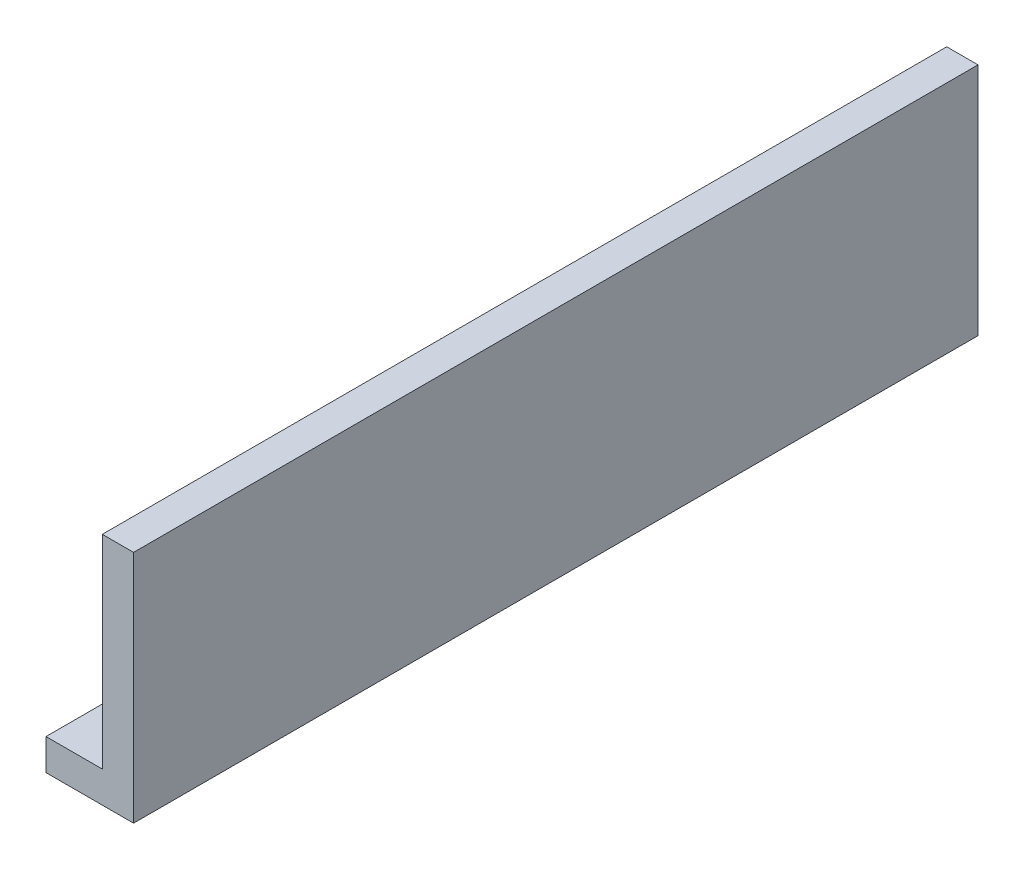
ISO-10303-21;
HEADER;
FILE_DESCRIPTION(('STEP AP214'),'2;1');
FILE_NAME('part.step','',(''),(''),'','','');
FILE_SCHEMA(('AUTOMOTIVE_DESIGN { 1 0 10303 214 1 1 1 1 }'));
ENDSEC;
DATA;
#1=APPLICATION_CONTEXT('core data for automotive mechanical design processes');
#2=APPLICATION_PROTOCOL_DEFINITION('international standard','automotive_design',2000,#1);
#3=PRODUCT_CONTEXT('',#1,'mechanical');
#4=PRODUCT('Part','Part','',(#3));
#5=PRODUCT_RELATED_PRODUCT_CATEGORY('part','',(#4));
#6=PRODUCT_DEFINITION_FORMATION('','',#4);
#7=PRODUCT_DEFINITION_CONTEXT('part definition',#1,'design');
#8=PRODUCT_DEFINITION('design','',#6,#7);
#9=PRODUCT_DEFINITION_SHAPE('','',#8);
#10=(LENGTH_UNIT() NAMED_UNIT(*) SI_UNIT(.MILLI.,.METRE.));
#11=(NAMED_UNIT(*) PLANE_ANGLE_UNIT() SI_UNIT($,.RADIAN.));
#12=(NAMED_UNIT(*) SI_UNIT($,.STERADIAN.) SOLID_ANGLE_UNIT());
#13=UNCERTAINTY_MEASURE_WITH_UNIT(LENGTH_MEASURE(1.E-05),#10,'distance_accuracy_value','');
#14=(GEOMETRIC_REPRESENTATION_CONTEXT(3) GLOBAL_UNCERTAINTY_ASSIGNED_CONTEXT((#13)) GLOBAL_UNIT_ASSIGNED_CONTEXT((#10,
#11,#12)) REPRESENTATION_CONTEXT('',''));
#15=CARTESIAN_POINT('',(0.,0.,0.));
#16=DIRECTION('',(0.,0.,1.));
#17=DIRECTION('',(1.,0.,0.));
#18=AXIS2_PLACEMENT_3D('',#15,#16,#17);
#19=CARTESIAN_POINT('',(0.,150.,-270.));
#20=DIRECTION('',(1.,0.,0.));
#21=DIRECTION('',(0.,0.,-1.));
#22=AXIS2_PLACEMENT_3D('',#19,#20,#21);
#23=PLANE('',#22);
#24=DIRECTION('',(0.,-1.,0.));
#25=VECTOR('',#24,1.);
#26=CARTESIAN_POINT('',(0.,150.,-270.));
#27=LINE('',#26,#25);
#28=CARTESIAN_POINT('',(0.,150.,-270.));
#29=VERTEX_POINT('',#28);
#30=CARTESIAN_POINT('',(0.,20.0000000000001,-270.));
#31=VERTEX_POINT('',#30);
#32=EDGE_CURVE('E138',#29,#31,#27,.T.);
#33=ORIENTED_EDGE('',*,*,#32,.T.);
#34=DIRECTION('',(0.,0.,1.));
#35=VECTOR('',#34,1.);
#36=CARTESIAN_POINT('',(0.,20.0000000000001,-270.));
#37=LINE('',#36,#35);
#38=CARTESIAN_POINT('',(0.,20.,270.));
#39=VERTEX_POINT('',#38);
#40=EDGE_CURVE('E103',#31,#39,#37,.T.);
#41=ORIENTED_EDGE('',*,*,#40,.T.);
#42=DIRECTION('',(0.,-1.,0.));
#43=VECTOR('',#42,1.);
#44=CARTESIAN_POINT('',(0.,150.,270.));
#45=LINE('',#44,#43);
#46=CARTESIAN_POINT('',(0.,150.,270.));
#47=VERTEX_POINT('',#46);
#48=EDGE_CURVE('E11',#47,#39,#45,.T.);
#49=ORIENTED_EDGE('',*,*,#48,.F.);
#50=DIRECTION('',(0.,0.,1.));
#51=VECTOR('',#50,1.);
#52=CARTESIAN_POINT('',(0.,150.,-270.));
#53=LINE('',#52,#51);
#54=EDGE_CURVE('E132',#29,#47,#53,.T.);
#55=ORIENTED_EDGE('',*,*,#54,.F.);
#56=EDGE_LOOP('',(#33,#41,#49,#55));
#57=FACE_BOUND('',#56,.T.);
#58=ADVANCED_FACE('F37',(#57),#23,.F.);
#59=CARTESIAN_POINT('',(0.,150.,270.));
#60=DIRECTION('',(0.,0.,-1.));
#61=DIRECTION('',(-1.,0.,0.));
#62=AXIS2_PLACEMENT_3D('',#59,#60,#61);
#63=PLANE('',#62);
#64=DIRECTION('',(1.,0.,0.));
#65=VECTOR('',#64,1.);
#66=CARTESIAN_POINT('',(0.,0.,270.));
#67=LINE('',#66,#65);
#68=CARTESIAN_POINT('',(-36.,0.,270.));
#69=VERTEX_POINT('',#68);
#70=CARTESIAN_POINT('',(20.0000000000001,0.,270.));
#71=VERTEX_POINT('',#70);
#72=EDGE_CURVE('E130',#69,#71,#67,.T.);
#73=ORIENTED_EDGE('',*,*,#72,.T.);
#74=DIRECTION('',(0.,-1.,0.));
#75=VECTOR('',#74,1.);
#76=CARTESIAN_POINT('',(20.0000000000001,150.,270.));
#77=LINE('',#76,#75);
#78=CARTESIAN_POINT('',(20.0000000000001,150.,270.));
#79=VERTEX_POINT('',#78);
#80=EDGE_CURVE('E45',#79,#71,#77,.T.);
#81=ORIENTED_EDGE('',*,*,#80,.F.);
#82=DIRECTION('',(1.,0.,0.));
#83=VECTOR('',#82,1.);
#84=CARTESIAN_POINT('',(0.,150.,270.));
#85=LINE('',#84,#83);
#86=EDGE_CURVE('E85',#47,#79,#85,.T.);
#87=ORIENTED_EDGE('',*,*,#86,.F.);
#88=ORIENTED_EDGE('',*,*,#48,.T.);
#89=DIRECTION('',(1.,0.,0.));
#90=VECTOR('',#89,1.);
#91=CARTESIAN_POINT('',(-36.,20.,270.));
#92=LINE('',#91,#90);
#93=CARTESIAN_POINT('',(-36.,20.,270.));
#94=VERTEX_POINT('',#93);
#95=EDGE_CURVE('E53',#94,#39,#92,.T.);
#96=ORIENTED_EDGE('',*,*,#95,.F.);
#97=DIRECTION('',(0.,-1.,0.));
#98=VECTOR('',#97,1.);
#99=CARTESIAN_POINT('',(-36.,20.,270.));
#100=LINE('',#99,#98);
#101=EDGE_CURVE('E117',#94,#69,#100,.T.);
#102=ORIENTED_EDGE('',*,*,#101,.T.);
#103=EDGE_LOOP('',(#73,#81,#87,#88,#96,#102));
#104=FACE_BOUND('',#103,.T.);
#105=ADVANCED_FACE('F201',(#104),#63,.F.);
#106=CARTESIAN_POINT('',(20.,150.,-270.));
#107=DIRECTION('',(-1.,0.,0.));
#108=DIRECTION('',(0.,0.,1.));
#109=AXIS2_PLACEMENT_3D('',#106,#107,#108);
#110=PLANE('',#109);
#111=DIRECTION('',(0.,0.,-1.));
#112=VECTOR('',#111,1.);
#113=CARTESIAN_POINT('',(20.,0.,-270.));
#114=LINE('',#113,#112);
#115=CARTESIAN_POINT('',(20.,0.,-270.));
#116=VERTEX_POINT('',#115);
#117=EDGE_CURVE('E78',#71,#116,#114,.T.);
#118=ORIENTED_EDGE('',*,*,#117,.T.);
#119=DIRECTION('',(0.,-1.,0.));
#120=VECTOR('',#119,1.);
#121=CARTESIAN_POINT('',(20.,150.,-270.));
#122=LINE('',#121,#120);
#123=CARTESIAN_POINT('',(20.,150.,-270.));
#124=VERTEX_POINT('',#123);
#125=EDGE_CURVE('E143',#124,#116,#122,.T.);
#126=ORIENTED_EDGE('',*,*,#125,.F.);
#127=DIRECTION('',(0.,0.,-1.));
#128=VECTOR('',#127,1.);
#129=CARTESIAN_POINT('',(20.,150.,-270.));
#130=LINE('',#129,#128);
#131=EDGE_CURVE('E135',#79,#124,#130,.T.);
#132=ORIENTED_EDGE('',*,*,#131,.F.);
#133=ORIENTED_EDGE('',*,*,#80,.T.);
#134=EDGE_LOOP('',(#118,#126,#132,#133));
#135=FACE_BOUND('',#134,.T.);
#136=ADVANCED_FACE('F206',(#135),#110,.F.);
#137=CARTESIAN_POINT('',(0.,150.,-270.));
#138=DIRECTION('',(0.,0.,1.));
#139=DIRECTION('',(1.,0.,0.));
#140=AXIS2_PLACEMENT_3D('',#137,#138,#139);
#141=PLANE('',#140);
#142=DIRECTION('',(-1.,0.,0.));
#143=VECTOR('',#142,1.);
#144=CARTESIAN_POINT('',(0.,0.,-270.));
#145=LINE('',#144,#143);
#146=CARTESIAN_POINT('',(-36.,0.,-270.));
#147=VERTEX_POINT('',#146);
#148=EDGE_CURVE('E121',#116,#147,#145,.T.);
#149=ORIENTED_EDGE('',*,*,#148,.T.);
#150=DIRECTION('',(0.,1.,0.));
#151=VECTOR('',#150,1.);
#152=CARTESIAN_POINT('',(-36.,20.0000000000001,-270.));
#153=LINE('',#152,#151);
#154=CARTESIAN_POINT('',(-36.,20.0000000000001,-270.));
#155=VERTEX_POINT('',#154);
#156=EDGE_CURVE('E114',#147,#155,#153,.T.);
#157=ORIENTED_EDGE('',*,*,#156,.T.);
#158=DIRECTION('',(1.,0.,0.));
#159=VECTOR('',#158,1.);
#160=CARTESIAN_POINT('',(-36.,20.0000000000001,-270.));
#161=LINE('',#160,#159);
#162=EDGE_CURVE('E99',#155,#31,#161,.T.);
#163=ORIENTED_EDGE('',*,*,#162,.T.);
#164=ORIENTED_EDGE('',*,*,#32,.F.);
#165=DIRECTION('',(-1.,0.,0.));
#166=VECTOR('',#165,1.);
#167=CARTESIAN_POINT('',(0.,150.,-270.));
#168=LINE('',#167,#166);
#169=EDGE_CURVE('E62',#124,#29,#168,.T.);
#170=ORIENTED_EDGE('',*,*,#169,.F.);
#171=ORIENTED_EDGE('',*,*,#125,.T.);
#172=EDGE_LOOP('',(#149,#157,#163,#164,#170,#171));
#173=FACE_BOUND('',#172,.T.);
#174=ADVANCED_FACE('F119',(#173),#141,.F.);
#175=CARTESIAN_POINT('',(0.,150.,0.));
#176=DIRECTION('',(0.,1.,0.));
#177=DIRECTION('',(0.,0.,1.));
#178=AXIS2_PLACEMENT_3D('',#175,#176,#177);
#179=PLANE('',#178);
#180=ORIENTED_EDGE('',*,*,#54,.T.);
#181=ORIENTED_EDGE('',*,*,#86,.T.);
#182=ORIENTED_EDGE('',*,*,#131,.T.);
#183=ORIENTED_EDGE('',*,*,#169,.T.);
#184=EDGE_LOOP('',(#180,#181,#182,#183));
#185=FACE_BOUND('',#184,.T.);
#186=ADVANCED_FACE('F194',(#185),#179,.T.);
#187=CARTESIAN_POINT('',(0.,0.,0.));
#188=DIRECTION('',(0.,1.,0.));
#189=DIRECTION('',(0.,0.,1.));
#190=AXIS2_PLACEMENT_3D('',#187,#188,#189);
#191=PLANE('',#190);
#192=CARTESIAN_POINT('',(-16.,0.,240.));
#193=DIRECTION('',(0.,1.,0.));
#194=DIRECTION('',(0.,0.,1.));
#195=AXIS2_PLACEMENT_3D('',#192,#193,#194);
#196=CIRCLE('',#195,4.24999999999998);
#197=CARTESIAN_POINT('',(-16.,0.,244.25));
#198=VERTEX_POINT('',#197);
#199=EDGE_CURVE('E167',#198,#198,#196,.T.);
#200=ORIENTED_EDGE('',*,*,#199,.T.);
#201=EDGE_LOOP('',(#200));
#202=FACE_BOUND('',#201,.T.);
#203=CARTESIAN_POINT('',(-16.,0.,160.));
#204=DIRECTION('',(0.,1.,0.));
#205=DIRECTION('',(0.,0.,1.));
#206=AXIS2_PLACEMENT_3D('',#203,#204,#205);
#207=CIRCLE('',#206,4.24999999999998);
#208=CARTESIAN_POINT('',(-16.,0.,164.25));
#209=VERTEX_POINT('',#208);
#210=EDGE_CURVE('E157',#209,#209,#207,.T.);
#211=ORIENTED_EDGE('',*,*,#210,.T.);
#212=EDGE_LOOP('',(#211));
#213=FACE_BOUND('',#212,.T.);
#214=CARTESIAN_POINT('',(-16.,0.,80.));
#215=DIRECTION('',(0.,1.,0.));
#216=DIRECTION('',(0.,0.,1.));
#217=AXIS2_PLACEMENT_3D('',#214,#215,#216);
#218=CIRCLE('',#217,4.24999999999998);
#219=CARTESIAN_POINT('',(-16.,0.,84.25));
#220=VERTEX_POINT('',#219);
#221=EDGE_CURVE('E154',#220,#220,#218,.T.);
#222=ORIENTED_EDGE('',*,*,#221,.T.);
#223=EDGE_LOOP('',(#222));
#224=FACE_BOUND('',#223,.T.);
#225=CARTESIAN_POINT('',(-16.,0.,-240.));
#226=DIRECTION('',(0.,1.,0.));
#227=DIRECTION('',(0.,0.,1.));
#228=AXIS2_PLACEMENT_3D('',#225,#226,#227);
#229=CIRCLE('',#228,4.24999999999998);
#230=CARTESIAN_POINT('',(-16.,0.,-235.75));
#231=VERTEX_POINT('',#230);
#232=EDGE_CURVE('E153',#231,#231,#229,.T.);
#233=ORIENTED_EDGE('',*,*,#232,.T.);
#234=EDGE_LOOP('',(#233));
#235=FACE_BOUND('',#234,.T.);
#236=CARTESIAN_POINT('',(-16.,0.,-160.));
#237=DIRECTION('',(0.,1.,0.));
#238=DIRECTION('',(0.,0.,1.));
#239=AXIS2_PLACEMENT_3D('',#236,#237,#238);
#240=CIRCLE('',#239,4.24999999999998);
#241=CARTESIAN_POINT('',(-16.,0.,-155.75));
#242=VERTEX_POINT('',#241);
#243=EDGE_CURVE('E150',#242,#242,#240,.T.);
#244=ORIENTED_EDGE('',*,*,#243,.T.);
#245=EDGE_LOOP('',(#244));
#246=FACE_BOUND('',#245,.T.);
#247=CARTESIAN_POINT('',(-16.,0.,-80.));
#248=DIRECTION('',(0.,1.,0.));
#249=DIRECTION('',(0.,0.,1.));
#250=AXIS2_PLACEMENT_3D('',#247,#248,#249);
#251=CIRCLE('',#250,4.24999999999998);
#252=CARTESIAN_POINT('',(-16.,0.,-75.75));
#253=VERTEX_POINT('',#252);
#254=EDGE_CURVE('E149',#253,#253,#251,.T.);
#255=ORIENTED_EDGE('',*,*,#254,.T.);
#256=EDGE_LOOP('',(#255));
#257=FACE_BOUND('',#256,.T.);
#258=ORIENTED_EDGE('',*,*,#72,.F.);
#259=DIRECTION('',(0.,0.,-1.));
#260=VECTOR('',#259,1.);
#261=CARTESIAN_POINT('',(-36.,0.,-270.));
#262=LINE('',#261,#260);
#263=EDGE_CURVE('E107',#69,#147,#262,.T.);
#264=ORIENTED_EDGE('',*,*,#263,.T.);
#265=ORIENTED_EDGE('',*,*,#148,.F.);
#266=ORIENTED_EDGE('',*,*,#117,.F.);
#267=EDGE_LOOP('',(#258,#264,#265,#266));
#268=FACE_BOUND('',#267,.T.);
#269=ADVANCED_FACE('F186',(#202,#213,#224,#235,#246,#257,#268),#191,.F.);
#270=CARTESIAN_POINT('',(-36.,20.0000000000001,-270.));
#271=DIRECTION('',(0.,1.,0.));
#272=DIRECTION('',(0.,0.,1.));
#273=AXIS2_PLACEMENT_3D('',#270,#271,#272);
#274=PLANE('',#273);
#275=CARTESIAN_POINT('',(-16.,20.,240.));
#276=DIRECTION('',(0.,1.,0.));
#277=DIRECTION('',(0.,0.,1.));
#278=AXIS2_PLACEMENT_3D('',#275,#276,#277);
#279=CIRCLE('',#278,4.24999999999999);
#280=CARTESIAN_POINT('',(-16.,20.,244.25));
#281=VERTEX_POINT('',#280);
#282=EDGE_CURVE('E40',#281,#281,#279,.T.);
#283=ORIENTED_EDGE('',*,*,#282,.F.);
#284=EDGE_LOOP('',(#283));
#285=FACE_BOUND('',#284,.T.);
#286=CARTESIAN_POINT('',(-16.,20.,160.));
#287=DIRECTION('',(0.,1.,0.));
#288=DIRECTION('',(0.,0.,1.));
#289=AXIS2_PLACEMENT_3D('',#286,#287,#288);
#290=CIRCLE('',#289,4.24999999999999);
#291=CARTESIAN_POINT('',(-16.,20.,164.25));
#292=VERTEX_POINT('',#291);
#293=EDGE_CURVE('E155',#292,#292,#290,.T.);
#294=ORIENTED_EDGE('',*,*,#293,.F.);
#295=EDGE_LOOP('',(#294));
#296=FACE_BOUND('',#295,.T.);
#297=CARTESIAN_POINT('',(-16.,20.,80.));
#298=DIRECTION('',(0.,1.,0.));
#299=DIRECTION('',(0.,0.,1.));
#300=AXIS2_PLACEMENT_3D('',#297,#298,#299);
#301=CIRCLE('',#300,4.24999999999999);
#302=CARTESIAN_POINT('',(-16.,20.,84.25));
#303=VERTEX_POINT('',#302);
#304=EDGE_CURVE('E151',#303,#303,#301,.T.);
#305=ORIENTED_EDGE('',*,*,#304,.F.);
#306=EDGE_LOOP('',(#305));
#307=FACE_BOUND('',#306,.T.);
#308=CARTESIAN_POINT('',(-16.,20.0000000000001,-240.));
#309=DIRECTION('',(0.,1.,0.));
#310=DIRECTION('',(0.,0.,1.));
#311=AXIS2_PLACEMENT_3D('',#308,#309,#310);
#312=CIRCLE('',#311,4.24999999999999);
#313=CARTESIAN_POINT('',(-16.,20.0000000000001,-235.75));
#314=VERTEX_POINT('',#313);
#315=EDGE_CURVE('E172',#314,#314,#312,.T.);
#316=ORIENTED_EDGE('',*,*,#315,.F.);
#317=EDGE_LOOP('',(#316));
#318=FACE_BOUND('',#317,.T.);
#319=CARTESIAN_POINT('',(-16.,20.,-160.));
#320=DIRECTION('',(0.,1.,0.));
#321=DIRECTION('',(0.,0.,1.));
#322=AXIS2_PLACEMENT_3D('',#319,#320,#321);
#323=CIRCLE('',#322,4.24999999999999);
#324=CARTESIAN_POINT('',(-16.,20.,-155.75));
#325=VERTEX_POINT('',#324);
#326=EDGE_CURVE('E146',#325,#325,#323,.T.);
#327=ORIENTED_EDGE('',*,*,#326,.F.);
#328=EDGE_LOOP('',(#327));
#329=FACE_BOUND('',#328,.T.);
#330=CARTESIAN_POINT('',(-16.,20.,-80.));
#331=DIRECTION('',(0.,1.,0.));
#332=DIRECTION('',(0.,0.,1.));
#333=AXIS2_PLACEMENT_3D('',#330,#331,#332);
#334=CIRCLE('',#333,4.24999999999999);
#335=CARTESIAN_POINT('',(-16.,20.,-75.75));
#336=VERTEX_POINT('',#335);
#337=EDGE_CURVE('E123',#336,#336,#334,.T.);
#338=ORIENTED_EDGE('',*,*,#337,.F.);
#339=EDGE_LOOP('',(#338));
#340=FACE_BOUND('',#339,.T.);
#341=ORIENTED_EDGE('',*,*,#40,.F.);
#342=ORIENTED_EDGE('',*,*,#162,.F.);
#343=DIRECTION('',(0.,0.,1.));
#344=VECTOR('',#343,1.);
#345=CARTESIAN_POINT('',(-36.,20.0000000000001,-270.));
#346=LINE('',#345,#344);
#347=EDGE_CURVE('E102',#155,#94,#346,.T.);
#348=ORIENTED_EDGE('',*,*,#347,.T.);
#349=ORIENTED_EDGE('',*,*,#95,.T.);
#350=EDGE_LOOP('',(#341,#342,#348,#349));
#351=FACE_BOUND('',#350,.T.);
#352=ADVANCED_FACE('F101',(#285,#296,#307,#318,#329,#340,#351),#274,.T.);
#353=CARTESIAN_POINT('',(-36.,0.,0.));
#354=DIRECTION('',(-1.,0.,0.));
#355=DIRECTION('',(0.,0.,1.));
#356=AXIS2_PLACEMENT_3D('',#353,#354,#355);
#357=PLANE('',#356);
#358=ORIENTED_EDGE('',*,*,#156,.F.);
#359=ORIENTED_EDGE('',*,*,#263,.F.);
#360=ORIENTED_EDGE('',*,*,#101,.F.);
#361=ORIENTED_EDGE('',*,*,#347,.F.);
#362=EDGE_LOOP('',(#358,#359,#360,#361));
#363=FACE_BOUND('',#362,.T.);
#364=ADVANCED_FACE('F112',(#363),#357,.T.);
#365=CARTESIAN_POINT('',(-16.,150.,-80.));
#366=DIRECTION('',(0.,1.,0.));
#367=DIRECTION('',(0.,0.,1.));
#368=AXIS2_PLACEMENT_3D('',#365,#366,#367);
#369=CYLINDRICAL_SURFACE('',#368,4.24999999999999);
#370=ORIENTED_EDGE('',*,*,#337,.T.);
#371=EDGE_LOOP('',(#370));
#372=FACE_BOUND('',#371,.T.);
#373=ORIENTED_EDGE('',*,*,#254,.F.);
#374=EDGE_LOOP('',(#373));
#375=FACE_BOUND('',#374,.T.);
#376=ADVANCED_FACE('F182',(#372,#375),#369,.F.);
#377=CARTESIAN_POINT('',(-16.,150.,-160.));
#378=DIRECTION('',(0.,1.,0.));
#379=DIRECTION('',(0.,0.,1.));
#380=AXIS2_PLACEMENT_3D('',#377,#378,#379);
#381=CYLINDRICAL_SURFACE('',#380,4.24999999999999);
#382=ORIENTED_EDGE('',*,*,#326,.T.);
#383=EDGE_LOOP('',(#382));
#384=FACE_BOUND('',#383,.T.);
#385=ORIENTED_EDGE('',*,*,#243,.F.);
#386=EDGE_LOOP('',(#385));
#387=FACE_BOUND('',#386,.T.);
#388=ADVANCED_FACE('F247',(#384,#387),#381,.F.);
#389=CARTESIAN_POINT('',(-16.,150.,-240.));
#390=DIRECTION('',(0.,1.,0.));
#391=DIRECTION('',(0.,0.,1.));
#392=AXIS2_PLACEMENT_3D('',#389,#390,#391);
#393=CYLINDRICAL_SURFACE('',#392,4.24999999999999);
#394=ORIENTED_EDGE('',*,*,#315,.T.);
#395=EDGE_LOOP('',(#394));
#396=FACE_BOUND('',#395,.T.);
#397=ORIENTED_EDGE('',*,*,#232,.F.);
#398=EDGE_LOOP('',(#397));
#399=FACE_BOUND('',#398,.T.);
#400=ADVANCED_FACE('F258',(#396,#399),#393,.F.);
#401=CARTESIAN_POINT('',(-16.,150.,80.));
#402=DIRECTION('',(0.,1.,0.));
#403=DIRECTION('',(0.,0.,1.));
#404=AXIS2_PLACEMENT_3D('',#401,#402,#403);
#405=CYLINDRICAL_SURFACE('',#404,4.24999999999999);
#406=ORIENTED_EDGE('',*,*,#304,.T.);
#407=EDGE_LOOP('',(#406));
#408=FACE_BOUND('',#407,.T.);
#409=ORIENTED_EDGE('',*,*,#221,.F.);
#410=EDGE_LOOP('',(#409));
#411=FACE_BOUND('',#410,.T.);
#412=ADVANCED_FACE('F270',(#408,#411),#405,.F.);
#413=CARTESIAN_POINT('',(-16.,150.,160.));
#414=DIRECTION('',(0.,1.,0.));
#415=DIRECTION('',(0.,0.,1.));
#416=AXIS2_PLACEMENT_3D('',#413,#414,#415);
#417=CYLINDRICAL_SURFACE('',#416,4.24999999999999);
#418=ORIENTED_EDGE('',*,*,#293,.T.);
#419=EDGE_LOOP('',(#418));
#420=FACE_BOUND('',#419,.T.);
#421=ORIENTED_EDGE('',*,*,#210,.F.);
#422=EDGE_LOOP('',(#421));
#423=FACE_BOUND('',#422,.T.);
#424=ADVANCED_FACE('F299',(#420,#423),#417,.F.);
#425=CARTESIAN_POINT('',(-16.,150.,240.));
#426=DIRECTION('',(0.,1.,0.));
#427=DIRECTION('',(0.,0.,1.));
#428=AXIS2_PLACEMENT_3D('',#425,#426,#427);
#429=CYLINDRICAL_SURFACE('',#428,4.24999999999999);
#430=ORIENTED_EDGE('',*,*,#282,.T.);
#431=EDGE_LOOP('',(#430));
#432=FACE_BOUND('',#431,.T.);
#433=ORIENTED_EDGE('',*,*,#199,.F.);
#434=EDGE_LOOP('',(#433));
#435=FACE_BOUND('',#434,.T.);
#436=ADVANCED_FACE('F311',(#432,#435),#429,.F.);
#437=CLOSED_SHELL('',(#58,#105,#136,#174,#186,#269,#352,#364,#376,#388,#400,#412,#424,#436));
#438=MANIFOLD_SOLID_BREP('B2',#437);
#439=ADVANCED_BREP_SHAPE_REPRESENTATION('',(#18,#438),#14);
#440=SHAPE_DEFINITION_REPRESENTATION(#9,#439);
ENDSEC;
END-ISO-10303-21;
